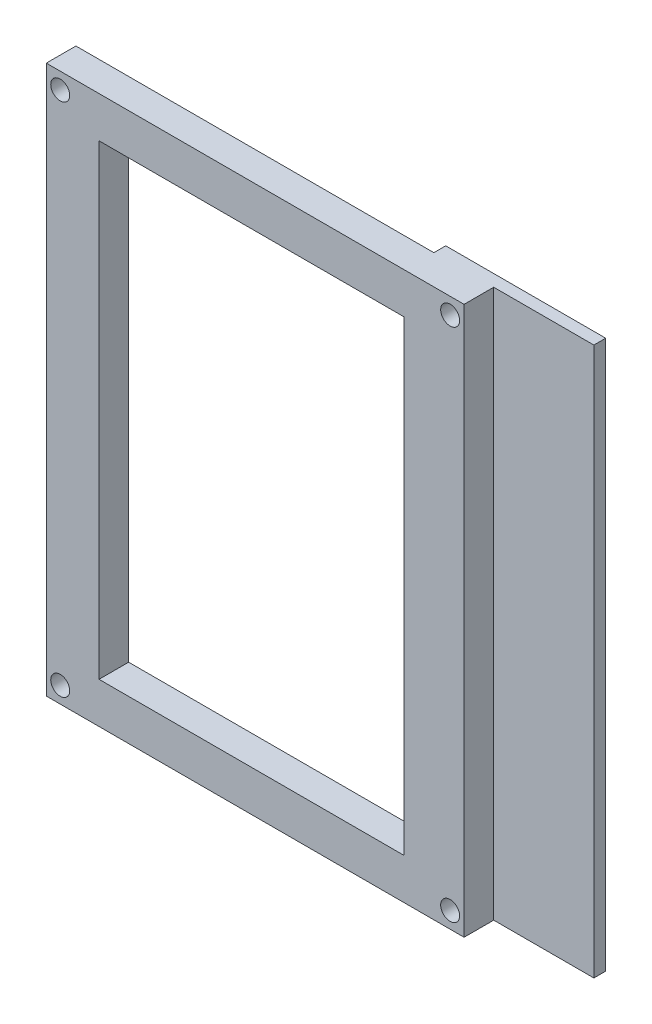
ISO-10303-21;
HEADER;
FILE_DESCRIPTION(('STEP AP214'),'2;1');
FILE_NAME('part.step','',(''),(''),'','','');
FILE_SCHEMA(('AUTOMOTIVE_DESIGN { 1 0 10303 214 1 1 1 1 }'));
ENDSEC;
DATA;
#1=APPLICATION_CONTEXT('core data for automotive mechanical design processes');
#2=APPLICATION_PROTOCOL_DEFINITION('international standard','automotive_design',2000,#1);
#3=PRODUCT_CONTEXT('',#1,'mechanical');
#4=PRODUCT('Part','Part','',(#3));
#5=PRODUCT_RELATED_PRODUCT_CATEGORY('part','',(#4));
#6=PRODUCT_DEFINITION_FORMATION('','',#4);
#7=PRODUCT_DEFINITION_CONTEXT('part definition',#1,'design');
#8=PRODUCT_DEFINITION('design','',#6,#7);
#9=PRODUCT_DEFINITION_SHAPE('','',#8);
#10=(LENGTH_UNIT() NAMED_UNIT(*) SI_UNIT(.MILLI.,.METRE.));
#11=(NAMED_UNIT(*) PLANE_ANGLE_UNIT() SI_UNIT($,.RADIAN.));
#12=(NAMED_UNIT(*) SI_UNIT($,.STERADIAN.) SOLID_ANGLE_UNIT());
#13=UNCERTAINTY_MEASURE_WITH_UNIT(LENGTH_MEASURE(1.E-05),#10,'distance_accuracy_value','');
#14=(GEOMETRIC_REPRESENTATION_CONTEXT(3) GLOBAL_UNCERTAINTY_ASSIGNED_CONTEXT((#13)) GLOBAL_UNIT_ASSIGNED_CONTEXT((#10,
#11,#12)) REPRESENTATION_CONTEXT('',''));
#15=CARTESIAN_POINT('',(0.,0.,0.));
#16=DIRECTION('',(0.,0.,1.));
#17=DIRECTION('',(1.,0.,0.));
#18=AXIS2_PLACEMENT_3D('',#15,#16,#17);
#19=CARTESIAN_POINT('',(0.,0.,23.));
#20=DIRECTION('',(0.,0.,-1.));
#21=DIRECTION('',(0.,1.,0.));
#22=AXIS2_PLACEMENT_3D('',#19,#20,#21);
#23=PLANE('',#22);
#24=DIRECTION('',(0.,1.,0.));
#25=VECTOR('',#24,1.);
#26=CARTESIAN_POINT('',(64.65,97.2500000000001,23.));
#27=LINE('',#26,#25);
#28=CARTESIAN_POINT('',(64.65,4.75000000000003,23.));
#29=VERTEX_POINT('',#28);
#30=CARTESIAN_POINT('',(64.65,11.65,23.));
#31=VERTEX_POINT('',#30);
#32=EDGE_CURVE('E54',#29,#31,#27,.T.);
#33=ORIENTED_EDGE('',*,*,#32,.F.);
#34=DIRECTION('',(1.,0.,0.));
#35=VECTOR('',#34,1.);
#36=CARTESIAN_POINT('',(4.24999999999998,4.75000000000003,23.));
#37=LINE('',#36,#35);
#38=CARTESIAN_POINT('',(4.24999999999998,4.75000000000003,23.));
#39=VERTEX_POINT('',#38);
#40=EDGE_CURVE('E200',#39,#29,#37,.T.);
#41=ORIENTED_EDGE('',*,*,#40,.F.);
#42=DIRECTION('',(0.,-1.,0.));
#43=VECTOR('',#42,1.);
#44=CARTESIAN_POINT('',(4.24999999999998,97.2500000000001,23.));
#45=LINE('',#44,#43);
#46=CARTESIAN_POINT('',(4.24999999999998,97.2500000000001,23.));
#47=VERTEX_POINT('',#46);
#48=EDGE_CURVE('E198',#47,#39,#45,.T.);
#49=ORIENTED_EDGE('',*,*,#48,.F.);
#50=DIRECTION('',(-1.,0.,0.));
#51=VECTOR('',#50,1.);
#52=CARTESIAN_POINT('',(4.24999999999998,97.2500000000001,23.));
#53=LINE('',#52,#51);
#54=CARTESIAN_POINT('',(64.65,97.2500000000001,23.));
#55=VERTEX_POINT('',#54);
#56=EDGE_CURVE('E212',#55,#47,#53,.T.);
#57=ORIENTED_EDGE('',*,*,#56,.F.);
#58=CARTESIAN_POINT('',(64.65,90.3500000000001,23.));
#59=VERTEX_POINT('',#58);
#60=EDGE_CURVE('E11',#59,#55,#27,.T.);
#61=ORIENTED_EDGE('',*,*,#60,.F.);
#62=DIRECTION('',(-1.,0.,0.));
#63=VECTOR('',#62,1.);
#64=CARTESIAN_POINT('',(13.15,90.3500000000001,23.));
#65=LINE('',#64,#63);
#66=CARTESIAN_POINT('',(13.15,90.3500000000001,23.));
#67=VERTEX_POINT('',#66);
#68=EDGE_CURVE('E197',#59,#67,#65,.T.);
#69=ORIENTED_EDGE('',*,*,#68,.T.);
#70=DIRECTION('',(0.,-1.,0.));
#71=VECTOR('',#70,1.);
#72=CARTESIAN_POINT('',(13.15,90.3500000000001,23.));
#73=LINE('',#72,#71);
#74=CARTESIAN_POINT('',(13.15,11.65,23.));
#75=VERTEX_POINT('',#74);
#76=EDGE_CURVE('E179',#67,#75,#73,.T.);
#77=ORIENTED_EDGE('',*,*,#76,.T.);
#78=DIRECTION('',(1.,0.,0.));
#79=VECTOR('',#78,1.);
#80=CARTESIAN_POINT('',(13.15,11.65,23.));
#81=LINE('',#80,#79);
#82=EDGE_CURVE('E181',#75,#31,#81,.T.);
#83=ORIENTED_EDGE('',*,*,#82,.T.);
#84=EDGE_LOOP('',(#33,#41,#49,#57,#61,#69,#77,#83));
#85=FACE_BOUND('',#84,.T.);
#86=CARTESIAN_POINT('',(6.59999999999997,7.50000000000007,23.));
#87=DIRECTION('',(0.,0.,-1.));
#88=DIRECTION('',(0.,1.,0.));
#89=AXIS2_PLACEMENT_3D('',#86,#87,#88);
#90=CIRCLE('',#89,1.6);
#91=CARTESIAN_POINT('',(6.59999999999997,9.10000000000008,23.));
#92=VERTEX_POINT('',#91);
#93=EDGE_CURVE('E46',#92,#92,#90,.T.);
#94=ORIENTED_EDGE('',*,*,#93,.F.);
#95=EDGE_LOOP('',(#94));
#96=FACE_BOUND('',#95,.T.);
#97=CARTESIAN_POINT('',(6.59999999999999,94.5000000000001,23.));
#98=DIRECTION('',(0.,0.,-1.));
#99=DIRECTION('',(0.,1.,0.));
#100=AXIS2_PLACEMENT_3D('',#97,#98,#99);
#101=CIRCLE('',#100,1.60000000000001);
#102=CARTESIAN_POINT('',(6.59999999999999,96.1000000000001,23.));
#103=VERTEX_POINT('',#102);
#104=EDGE_CURVE('E236',#103,#103,#101,.T.);
#105=ORIENTED_EDGE('',*,*,#104,.F.);
#106=EDGE_LOOP('',(#105));
#107=FACE_BOUND('',#106,.T.);
#108=ADVANCED_FACE('F37',(#85,#96,#107),#23,.T.);
#109=CARTESIAN_POINT('',(0.,0.,28.));
#110=DIRECTION('',(0.,0.,-1.));
#111=DIRECTION('',(0.,1.,0.));
#112=AXIS2_PLACEMENT_3D('',#109,#110,#111);
#113=PLANE('',#112);
#114=DIRECTION('',(1.,0.,0.));
#115=VECTOR('',#114,1.);
#116=CARTESIAN_POINT('',(13.15,11.65,28.));
#117=LINE('',#116,#115);
#118=CARTESIAN_POINT('',(13.15,11.65,28.));
#119=VERTEX_POINT('',#118);
#120=CARTESIAN_POINT('',(64.65,11.65,28.));
#121=VERTEX_POINT('',#120);
#122=EDGE_CURVE('E158',#119,#121,#117,.T.);
#123=ORIENTED_EDGE('',*,*,#122,.F.);
#124=DIRECTION('',(0.,-1.,0.));
#125=VECTOR('',#124,1.);
#126=CARTESIAN_POINT('',(13.15,90.3500000000001,28.));
#127=LINE('',#126,#125);
#128=CARTESIAN_POINT('',(13.15,90.3500000000001,28.));
#129=VERTEX_POINT('',#128);
#130=EDGE_CURVE('E156',#129,#119,#127,.T.);
#131=ORIENTED_EDGE('',*,*,#130,.F.);
#132=DIRECTION('',(-1.,0.,0.));
#133=VECTOR('',#132,1.);
#134=CARTESIAN_POINT('',(13.15,90.3500000000001,28.));
#135=LINE('',#134,#133);
#136=CARTESIAN_POINT('',(64.65,90.3500000000001,28.));
#137=VERTEX_POINT('',#136);
#138=EDGE_CURVE('E182',#137,#129,#135,.T.);
#139=ORIENTED_EDGE('',*,*,#138,.F.);
#140=DIRECTION('',(0.,1.,0.));
#141=VECTOR('',#140,1.);
#142=CARTESIAN_POINT('',(64.65,90.3500000000001,28.));
#143=LINE('',#142,#141);
#144=EDGE_CURVE('E185',#121,#137,#143,.T.);
#145=ORIENTED_EDGE('',*,*,#144,.F.);
#146=EDGE_LOOP('',(#123,#131,#139,#145));
#147=FACE_BOUND('',#146,.T.);
#148=CARTESIAN_POINT('',(6.59999999999997,7.50000000000007,28.));
#149=DIRECTION('',(0.,0.,-1.));
#150=DIRECTION('',(0.,1.,0.));
#151=AXIS2_PLACEMENT_3D('',#148,#149,#150);
#152=CIRCLE('',#151,1.6);
#153=CARTESIAN_POINT('',(6.59999999999997,9.10000000000008,28.));
#154=VERTEX_POINT('',#153);
#155=EDGE_CURVE('E210',#154,#154,#152,.T.);
#156=ORIENTED_EDGE('',*,*,#155,.T.);
#157=EDGE_LOOP('',(#156));
#158=FACE_BOUND('',#157,.T.);
#159=CARTESIAN_POINT('',(72.4,7.50000000000005,28.));
#160=DIRECTION('',(0.,0.,-1.));
#161=DIRECTION('',(0.,1.,0.));
#162=AXIS2_PLACEMENT_3D('',#159,#160,#161);
#163=CIRCLE('',#162,1.6);
#164=CARTESIAN_POINT('',(72.4,9.10000000000005,28.));
#165=VERTEX_POINT('',#164);
#166=EDGE_CURVE('E239',#165,#165,#163,.T.);
#167=ORIENTED_EDGE('',*,*,#166,.T.);
#168=EDGE_LOOP('',(#167));
#169=FACE_BOUND('',#168,.T.);
#170=CARTESIAN_POINT('',(6.59999999999999,94.5000000000001,28.));
#171=DIRECTION('',(0.,0.,-1.));
#172=DIRECTION('',(0.,1.,0.));
#173=AXIS2_PLACEMENT_3D('',#170,#171,#172);
#174=CIRCLE('',#173,1.60000000000001);
#175=CARTESIAN_POINT('',(6.59999999999999,96.1000000000001,28.));
#176=VERTEX_POINT('',#175);
#177=EDGE_CURVE('E235',#176,#176,#174,.T.);
#178=ORIENTED_EDGE('',*,*,#177,.T.);
#179=EDGE_LOOP('',(#178));
#180=FACE_BOUND('',#179,.T.);
#181=CARTESIAN_POINT('',(72.4,94.5000000000001,28.));
#182=DIRECTION('',(0.,0.,-1.));
#183=DIRECTION('',(0.,1.,0.));
#184=AXIS2_PLACEMENT_3D('',#181,#182,#183);
#185=CIRCLE('',#184,1.60000000000001);
#186=CARTESIAN_POINT('',(72.4,96.1000000000001,28.));
#187=VERTEX_POINT('',#186);
#188=EDGE_CURVE('E229',#187,#187,#185,.T.);
#189=ORIENTED_EDGE('',*,*,#188,.T.);
#190=EDGE_LOOP('',(#189));
#191=FACE_BOUND('',#190,.T.);
#192=DIRECTION('',(0.,-1.,0.));
#193=VECTOR('',#192,1.);
#194=CARTESIAN_POINT('',(4.24999999999998,97.2500000000001,28.));
#195=LINE('',#194,#193);
#196=CARTESIAN_POINT('',(4.24999999999998,97.2500000000001,28.));
#197=VERTEX_POINT('',#196);
#198=CARTESIAN_POINT('',(4.24999999999998,4.75000000000003,28.));
#199=VERTEX_POINT('',#198);
#200=EDGE_CURVE('E192',#197,#199,#195,.T.);
#201=ORIENTED_EDGE('',*,*,#200,.T.);
#202=DIRECTION('',(1.,0.,0.));
#203=VECTOR('',#202,1.);
#204=CARTESIAN_POINT('',(4.24999999999998,4.75000000000003,28.));
#205=LINE('',#204,#203);
#206=CARTESIAN_POINT('',(74.75,4.75000000000003,28.));
#207=VERTEX_POINT('',#206);
#208=EDGE_CURVE('E219',#199,#207,#205,.T.);
#209=ORIENTED_EDGE('',*,*,#208,.T.);
#210=DIRECTION('',(0.,1.,0.));
#211=VECTOR('',#210,1.);
#212=CARTESIAN_POINT('',(74.75,97.2500000000001,28.));
#213=LINE('',#212,#211);
#214=CARTESIAN_POINT('',(74.75,97.2500000000001,28.));
#215=VERTEX_POINT('',#214);
#216=EDGE_CURVE('E222',#207,#215,#213,.T.);
#217=ORIENTED_EDGE('',*,*,#216,.T.);
#218=DIRECTION('',(-1.,0.,0.));
#219=VECTOR('',#218,1.);
#220=CARTESIAN_POINT('',(4.24999999999998,97.2500000000001,28.));
#221=LINE('',#220,#219);
#222=EDGE_CURVE('E201',#215,#197,#221,.T.);
#223=ORIENTED_EDGE('',*,*,#222,.T.);
#224=EDGE_LOOP('',(#201,#209,#217,#223));
#225=FACE_BOUND('',#224,.T.);
#226=ADVANCED_FACE('F39',(#147,#158,#169,#180,#191,#225),#113,.F.);
#227=CARTESIAN_POINT('',(6.59999999999997,7.50000000000007,23.));
#228=DIRECTION('',(0.,0.,1.));
#229=DIRECTION('',(0.,-1.,0.));
#230=AXIS2_PLACEMENT_3D('',#227,#228,#229);
#231=CYLINDRICAL_SURFACE('',#230,1.6);
#232=ORIENTED_EDGE('',*,*,#93,.T.);
#233=EDGE_LOOP('',(#232));
#234=FACE_BOUND('',#233,.T.);
#235=ORIENTED_EDGE('',*,*,#155,.F.);
#236=EDGE_LOOP('',(#235));
#237=FACE_BOUND('',#236,.T.);
#238=ADVANCED_FACE('F251',(#234,#237),#231,.F.);
#239=CARTESIAN_POINT('',(72.4,7.50000000000005,23.));
#240=DIRECTION('',(0.,0.,1.));
#241=DIRECTION('',(0.,-1.,0.));
#242=AXIS2_PLACEMENT_3D('',#239,#240,#241);
#243=CYLINDRICAL_SURFACE('',#242,1.6);
#244=ORIENTED_EDGE('',*,*,#166,.F.);
#245=EDGE_LOOP('',(#244));
#246=FACE_BOUND('',#245,.T.);
#247=CARTESIAN_POINT('',(72.4,7.50000000000005,21.));
#248=DIRECTION('',(0.,0.,-1.));
#249=DIRECTION('',(0.,1.,0.));
#250=AXIS2_PLACEMENT_3D('',#247,#248,#249);
#251=CIRCLE('',#250,1.60000000000001);
#252=CARTESIAN_POINT('',(72.4,9.10000000000005,21.));
#253=VERTEX_POINT('',#252);
#254=EDGE_CURVE('E311',#253,#253,#251,.T.);
#255=ORIENTED_EDGE('',*,*,#254,.T.);
#256=EDGE_LOOP('',(#255));
#257=FACE_BOUND('',#256,.T.);
#258=ADVANCED_FACE('F253',(#246,#257),#243,.F.);
#259=CARTESIAN_POINT('',(6.59999999999999,94.5000000000001,23.));
#260=DIRECTION('',(0.,0.,1.));
#261=DIRECTION('',(0.,-1.,0.));
#262=AXIS2_PLACEMENT_3D('',#259,#260,#261);
#263=CYLINDRICAL_SURFACE('',#262,1.60000000000001);
#264=ORIENTED_EDGE('',*,*,#104,.T.);
#265=EDGE_LOOP('',(#264));
#266=FACE_BOUND('',#265,.T.);
#267=ORIENTED_EDGE('',*,*,#177,.F.);
#268=EDGE_LOOP('',(#267));
#269=FACE_BOUND('',#268,.T.);
#270=ADVANCED_FACE('F259',(#266,#269),#263,.F.);
#271=CARTESIAN_POINT('',(72.4,94.5000000000001,23.));
#272=DIRECTION('',(0.,0.,1.));
#273=DIRECTION('',(0.,-1.,0.));
#274=AXIS2_PLACEMENT_3D('',#271,#272,#273);
#275=CYLINDRICAL_SURFACE('',#274,1.60000000000001);
#276=ORIENTED_EDGE('',*,*,#188,.F.);
#277=EDGE_LOOP('',(#276));
#278=FACE_BOUND('',#277,.T.);
#279=CARTESIAN_POINT('',(72.4,94.5000000000001,21.));
#280=DIRECTION('',(0.,0.,-1.));
#281=DIRECTION('',(0.,1.,0.));
#282=AXIS2_PLACEMENT_3D('',#279,#280,#281);
#283=CIRCLE('',#282,1.60000000000001);
#284=CARTESIAN_POINT('',(72.4,96.1000000000001,21.));
#285=VERTEX_POINT('',#284);
#286=EDGE_CURVE('E167',#285,#285,#283,.T.);
#287=ORIENTED_EDGE('',*,*,#286,.T.);
#288=EDGE_LOOP('',(#287));
#289=FACE_BOUND('',#288,.T.);
#290=ADVANCED_FACE('F274',(#278,#289),#275,.F.);
#291=CARTESIAN_POINT('',(4.24999999999998,97.2500000000001,23.));
#292=DIRECTION('',(-1.,0.,0.));
#293=DIRECTION('',(0.,-1.,0.));
#294=AXIS2_PLACEMENT_3D('',#291,#292,#293);
#295=PLANE('',#294);
#296=ORIENTED_EDGE('',*,*,#200,.F.);
#297=DIRECTION('',(0.,0.,1.));
#298=VECTOR('',#297,1.);
#299=CARTESIAN_POINT('',(4.24999999999998,97.2500000000001,23.));
#300=LINE('',#299,#298);
#301=EDGE_CURVE('E227',#47,#197,#300,.T.);
#302=ORIENTED_EDGE('',*,*,#301,.F.);
#303=ORIENTED_EDGE('',*,*,#48,.T.);
#304=DIRECTION('',(0.,0.,1.));
#305=VECTOR('',#304,1.);
#306=CARTESIAN_POINT('',(4.24999999999998,4.75000000000003,23.));
#307=LINE('',#306,#305);
#308=EDGE_CURVE('E213',#39,#199,#307,.T.);
#309=ORIENTED_EDGE('',*,*,#308,.T.);
#310=EDGE_LOOP('',(#296,#302,#303,#309));
#311=FACE_BOUND('',#310,.T.);
#312=ADVANCED_FACE('F285',(#311),#295,.T.);
#313=CARTESIAN_POINT('',(4.24999999999998,97.2500000000001,23.));
#314=DIRECTION('',(0.,1.,0.));
#315=DIRECTION('',(0.,0.,1.));
#316=AXIS2_PLACEMENT_3D('',#313,#314,#315);
#317=PLANE('',#316);
#318=ORIENTED_EDGE('',*,*,#222,.F.);
#319=DIRECTION('',(0.,0.,1.));
#320=VECTOR('',#319,1.);
#321=CARTESIAN_POINT('',(74.75,97.2500000000001,23.));
#322=LINE('',#321,#320);
#323=CARTESIAN_POINT('',(74.75,97.2500000000001,23.));
#324=VERTEX_POINT('',#323);
#325=EDGE_CURVE('E230',#324,#215,#322,.T.);
#326=ORIENTED_EDGE('',*,*,#325,.F.);
#327=DIRECTION('',(1.,0.,0.));
#328=VECTOR('',#327,1.);
#329=CARTESIAN_POINT('',(64.65,97.2500000000001,23.));
#330=LINE('',#329,#328);
#331=CARTESIAN_POINT('',(91.65,97.2500000000001,23.));
#332=VERTEX_POINT('',#331);
#333=EDGE_CURVE('E154',#324,#332,#330,.T.);
#334=ORIENTED_EDGE('',*,*,#333,.T.);
#335=DIRECTION('',(0.,0.,1.));
#336=VECTOR('',#335,1.);
#337=CARTESIAN_POINT('',(91.65,97.2500000000001,21.));
#338=LINE('',#337,#336);
#339=CARTESIAN_POINT('',(91.65,97.2500000000001,21.));
#340=VERTEX_POINT('',#339);
#341=EDGE_CURVE('E134',#340,#332,#338,.T.);
#342=ORIENTED_EDGE('',*,*,#341,.F.);
#343=DIRECTION('',(1.,0.,0.));
#344=VECTOR('',#343,1.);
#345=CARTESIAN_POINT('',(64.65,97.2500000000001,21.));
#346=LINE('',#345,#344);
#347=CARTESIAN_POINT('',(64.65,97.2500000000001,21.));
#348=VERTEX_POINT('',#347);
#349=EDGE_CURVE('E140',#348,#340,#346,.T.);
#350=ORIENTED_EDGE('',*,*,#349,.F.);
#351=DIRECTION('',(0.,0.,1.));
#352=VECTOR('',#351,1.);
#353=CARTESIAN_POINT('',(64.65,97.2500000000001,21.));
#354=LINE('',#353,#352);
#355=EDGE_CURVE('E307',#348,#55,#354,.T.);
#356=ORIENTED_EDGE('',*,*,#355,.T.);
#357=ORIENTED_EDGE('',*,*,#56,.T.);
#358=ORIENTED_EDGE('',*,*,#301,.T.);
#359=EDGE_LOOP('',(#318,#326,#334,#342,#350,#356,#357,#358));
#360=FACE_BOUND('',#359,.T.);
#361=ADVANCED_FACE('F152',(#360),#317,.T.);
#362=CARTESIAN_POINT('',(74.75,97.2500000000001,23.));
#363=DIRECTION('',(1.,0.,0.));
#364=DIRECTION('',(0.,0.,-1.));
#365=AXIS2_PLACEMENT_3D('',#362,#363,#364);
#366=PLANE('',#365);
#367=ORIENTED_EDGE('',*,*,#216,.F.);
#368=DIRECTION('',(0.,0.,1.));
#369=VECTOR('',#368,1.);
#370=CARTESIAN_POINT('',(74.75,4.75000000000003,23.));
#371=LINE('',#370,#369);
#372=CARTESIAN_POINT('',(74.75,4.75000000000003,23.));
#373=VERTEX_POINT('',#372);
#374=EDGE_CURVE('E232',#373,#207,#371,.T.);
#375=ORIENTED_EDGE('',*,*,#374,.F.);
#376=DIRECTION('',(0.,1.,0.));
#377=VECTOR('',#376,1.);
#378=CARTESIAN_POINT('',(74.75,97.2500000000001,23.));
#379=LINE('',#378,#377);
#380=EDGE_CURVE('E209',#373,#324,#379,.T.);
#381=ORIENTED_EDGE('',*,*,#380,.T.);
#382=ORIENTED_EDGE('',*,*,#325,.T.);
#383=EDGE_LOOP('',(#367,#375,#381,#382));
#384=FACE_BOUND('',#383,.T.);
#385=ADVANCED_FACE('F302',(#384),#366,.T.);
#386=CARTESIAN_POINT('',(4.24999999999998,4.75000000000003,23.));
#387=DIRECTION('',(0.,-1.,0.));
#388=DIRECTION('',(0.,0.,-1.));
#389=AXIS2_PLACEMENT_3D('',#386,#387,#388);
#390=PLANE('',#389);
#391=ORIENTED_EDGE('',*,*,#208,.F.);
#392=ORIENTED_EDGE('',*,*,#308,.F.);
#393=ORIENTED_EDGE('',*,*,#40,.T.);
#394=DIRECTION('',(0.,0.,1.));
#395=VECTOR('',#394,1.);
#396=CARTESIAN_POINT('',(64.65,4.75000000000003,21.));
#397=LINE('',#396,#395);
#398=CARTESIAN_POINT('',(64.65,4.75000000000003,21.));
#399=VERTEX_POINT('',#398);
#400=EDGE_CURVE('E160',#399,#29,#397,.T.);
#401=ORIENTED_EDGE('',*,*,#400,.F.);
#402=DIRECTION('',(-1.,0.,0.));
#403=VECTOR('',#402,1.);
#404=CARTESIAN_POINT('',(64.65,4.75000000000003,21.));
#405=LINE('',#404,#403);
#406=CARTESIAN_POINT('',(91.65,4.75000000000002,21.));
#407=VERTEX_POINT('',#406);
#408=EDGE_CURVE('E139',#407,#399,#405,.T.);
#409=ORIENTED_EDGE('',*,*,#408,.F.);
#410=DIRECTION('',(0.,0.,1.));
#411=VECTOR('',#410,1.);
#412=CARTESIAN_POINT('',(91.65,4.75000000000002,21.));
#413=LINE('',#412,#411);
#414=CARTESIAN_POINT('',(91.65,4.75000000000002,23.));
#415=VERTEX_POINT('',#414);
#416=EDGE_CURVE('E136',#407,#415,#413,.T.);
#417=ORIENTED_EDGE('',*,*,#416,.T.);
#418=DIRECTION('',(-1.,0.,0.));
#419=VECTOR('',#418,1.);
#420=CARTESIAN_POINT('',(64.65,4.75000000000003,23.));
#421=LINE('',#420,#419);
#422=EDGE_CURVE('E174',#415,#373,#421,.T.);
#423=ORIENTED_EDGE('',*,*,#422,.T.);
#424=ORIENTED_EDGE('',*,*,#374,.T.);
#425=EDGE_LOOP('',(#391,#392,#393,#401,#409,#417,#423,#424));
#426=FACE_BOUND('',#425,.T.);
#427=ADVANCED_FACE('F290',(#426),#390,.T.);
#428=CARTESIAN_POINT('',(13.15,90.3500000000001,23.));
#429=DIRECTION('',(-1.,0.,0.));
#430=DIRECTION('',(0.,-1.,0.));
#431=AXIS2_PLACEMENT_3D('',#428,#429,#430);
#432=PLANE('',#431);
#433=ORIENTED_EDGE('',*,*,#130,.T.);
#434=DIRECTION('',(0.,0.,1.));
#435=VECTOR('',#434,1.);
#436=CARTESIAN_POINT('',(13.15,11.65,23.));
#437=LINE('',#436,#435);
#438=EDGE_CURVE('E194',#75,#119,#437,.T.);
#439=ORIENTED_EDGE('',*,*,#438,.F.);
#440=ORIENTED_EDGE('',*,*,#76,.F.);
#441=DIRECTION('',(0.,0.,1.));
#442=VECTOR('',#441,1.);
#443=CARTESIAN_POINT('',(13.15,90.3500000000001,23.));
#444=LINE('',#443,#442);
#445=EDGE_CURVE('E190',#67,#129,#444,.T.);
#446=ORIENTED_EDGE('',*,*,#445,.T.);
#447=EDGE_LOOP('',(#433,#439,#440,#446));
#448=FACE_BOUND('',#447,.T.);
#449=ADVANCED_FACE('F333',(#448),#432,.F.);
#450=CARTESIAN_POINT('',(13.15,90.3500000000001,23.));
#451=DIRECTION('',(0.,1.,0.));
#452=DIRECTION('',(0.,0.,1.));
#453=AXIS2_PLACEMENT_3D('',#450,#451,#452);
#454=PLANE('',#453);
#455=ORIENTED_EDGE('',*,*,#138,.T.);
#456=ORIENTED_EDGE('',*,*,#445,.F.);
#457=ORIENTED_EDGE('',*,*,#68,.F.);
#458=DIRECTION('',(0.,0.,1.));
#459=VECTOR('',#458,1.);
#460=CARTESIAN_POINT('',(64.65,90.3500000000001,23.));
#461=LINE('',#460,#459);
#462=EDGE_CURVE('E193',#59,#137,#461,.T.);
#463=ORIENTED_EDGE('',*,*,#462,.T.);
#464=EDGE_LOOP('',(#455,#456,#457,#463));
#465=FACE_BOUND('',#464,.T.);
#466=ADVANCED_FACE('F330',(#465),#454,.F.);
#467=CARTESIAN_POINT('',(64.65,90.3500000000001,23.));
#468=DIRECTION('',(1.,0.,0.));
#469=DIRECTION('',(0.,0.,-1.));
#470=AXIS2_PLACEMENT_3D('',#467,#468,#469);
#471=PLANE('',#470);
#472=ORIENTED_EDGE('',*,*,#144,.T.);
#473=ORIENTED_EDGE('',*,*,#462,.F.);
#474=ORIENTED_EDGE('',*,*,#60,.T.);
#475=ORIENTED_EDGE('',*,*,#355,.F.);
#476=DIRECTION('',(0.,1.,0.));
#477=VECTOR('',#476,1.);
#478=CARTESIAN_POINT('',(64.65,97.2500000000001,21.));
#479=LINE('',#478,#477);
#480=EDGE_CURVE('E146',#399,#348,#479,.T.);
#481=ORIENTED_EDGE('',*,*,#480,.F.);
#482=ORIENTED_EDGE('',*,*,#400,.T.);
#483=ORIENTED_EDGE('',*,*,#32,.T.);
#484=DIRECTION('',(0.,0.,1.));
#485=VECTOR('',#484,1.);
#486=CARTESIAN_POINT('',(64.65,11.65,23.));
#487=LINE('',#486,#485);
#488=EDGE_CURVE('E62',#31,#121,#487,.T.);
#489=ORIENTED_EDGE('',*,*,#488,.T.);
#490=EDGE_LOOP('',(#472,#473,#474,#475,#481,#482,#483,#489));
#491=FACE_BOUND('',#490,.T.);
#492=ADVANCED_FACE('F324',(#491),#471,.F.);
#493=CARTESIAN_POINT('',(13.15,11.65,23.));
#494=DIRECTION('',(0.,-1.,0.));
#495=DIRECTION('',(0.,0.,-1.));
#496=AXIS2_PLACEMENT_3D('',#493,#494,#495);
#497=PLANE('',#496);
#498=ORIENTED_EDGE('',*,*,#122,.T.);
#499=ORIENTED_EDGE('',*,*,#488,.F.);
#500=ORIENTED_EDGE('',*,*,#82,.F.);
#501=ORIENTED_EDGE('',*,*,#438,.T.);
#502=EDGE_LOOP('',(#498,#499,#500,#501));
#503=FACE_BOUND('',#502,.T.);
#504=ADVANCED_FACE('F316',(#503),#497,.F.);
#505=CARTESIAN_POINT('',(0.,0.,21.));
#506=DIRECTION('',(0.,0.,-1.));
#507=DIRECTION('',(0.,1.,0.));
#508=AXIS2_PLACEMENT_3D('',#505,#506,#507);
#509=PLANE('',#508);
#510=ORIENTED_EDGE('',*,*,#286,.F.);
#511=EDGE_LOOP('',(#510));
#512=FACE_BOUND('',#511,.T.);
#513=ORIENTED_EDGE('',*,*,#349,.T.);
#514=DIRECTION('',(0.,-1.,0.));
#515=VECTOR('',#514,1.);
#516=CARTESIAN_POINT('',(91.65,97.2500000000001,21.));
#517=LINE('',#516,#515);
#518=EDGE_CURVE('E130',#340,#407,#517,.T.);
#519=ORIENTED_EDGE('',*,*,#518,.T.);
#520=ORIENTED_EDGE('',*,*,#408,.T.);
#521=ORIENTED_EDGE('',*,*,#480,.T.);
#522=EDGE_LOOP('',(#513,#519,#520,#521));
#523=FACE_BOUND('',#522,.T.);
#524=ORIENTED_EDGE('',*,*,#254,.F.);
#525=EDGE_LOOP('',(#524));
#526=FACE_BOUND('',#525,.T.);
#527=ADVANCED_FACE('F143',(#512,#523,#526),#509,.T.);
#528=CARTESIAN_POINT('',(0.,0.,23.));
#529=DIRECTION('',(0.,0.,-1.));
#530=DIRECTION('',(0.,1.,0.));
#531=AXIS2_PLACEMENT_3D('',#528,#529,#530);
#532=PLANE('',#531);
#533=ORIENTED_EDGE('',*,*,#380,.F.);
#534=ORIENTED_EDGE('',*,*,#422,.F.);
#535=DIRECTION('',(0.,-1.,0.));
#536=VECTOR('',#535,1.);
#537=CARTESIAN_POINT('',(91.65,97.2500000000001,23.));
#538=LINE('',#537,#536);
#539=EDGE_CURVE('E166',#332,#415,#538,.T.);
#540=ORIENTED_EDGE('',*,*,#539,.F.);
#541=ORIENTED_EDGE('',*,*,#333,.F.);
#542=EDGE_LOOP('',(#533,#534,#540,#541));
#543=FACE_BOUND('',#542,.T.);
#544=ADVANCED_FACE('F304',(#543),#532,.F.);
#545=CARTESIAN_POINT('',(91.65,97.2500000000001,21.));
#546=DIRECTION('',(-1.,0.,0.));
#547=DIRECTION('',(0.,-1.,0.));
#548=AXIS2_PLACEMENT_3D('',#545,#546,#547);
#549=PLANE('',#548);
#550=ORIENTED_EDGE('',*,*,#539,.T.);
#551=ORIENTED_EDGE('',*,*,#416,.F.);
#552=ORIENTED_EDGE('',*,*,#518,.F.);
#553=ORIENTED_EDGE('',*,*,#341,.T.);
#554=EDGE_LOOP('',(#550,#551,#552,#553));
#555=FACE_BOUND('',#554,.T.);
#556=ADVANCED_FACE('F132',(#555),#549,.F.);
#557=CLOSED_SHELL('',(#108,#226,#238,#258,#270,#290,#312,#361,#385,#427,#449,#466,#492,#504,
#527,#544,#556));
#558=MANIFOLD_SOLID_BREP('B2',#557);
#559=ADVANCED_BREP_SHAPE_REPRESENTATION('',(#18,#558),#14);
#560=SHAPE_DEFINITION_REPRESENTATION(#9,#559);
ENDSEC;
END-ISO-10303-21;
